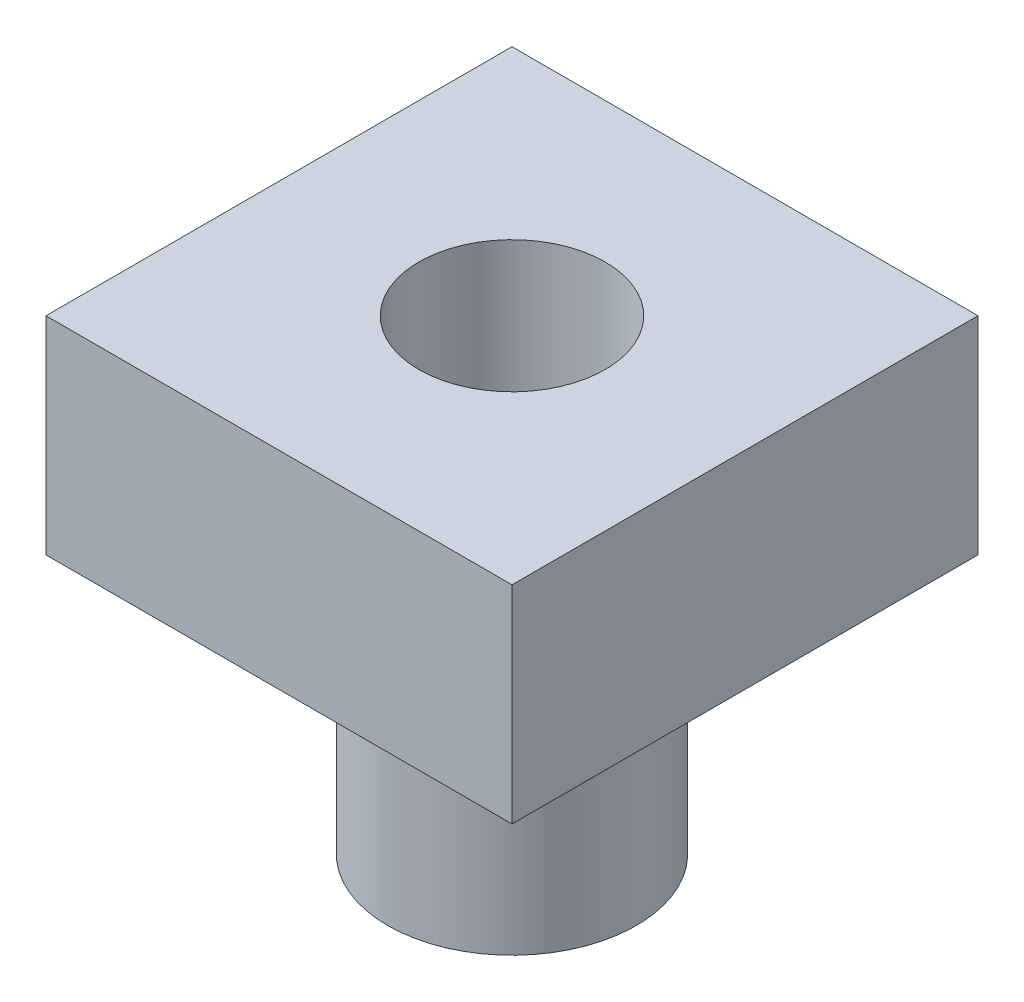
ISO-10303-21;
HEADER;
FILE_DESCRIPTION(('STEP AP214'),'2;1');
FILE_NAME('part.step','',(''),(''),'','','');
FILE_SCHEMA(('AUTOMOTIVE_DESIGN { 1 0 10303 214 1 1 1 1 }'));
ENDSEC;
DATA;
#1=APPLICATION_CONTEXT('core data for automotive mechanical design processes');
#2=APPLICATION_PROTOCOL_DEFINITION('international standard','automotive_design',2000,#1);
#3=PRODUCT_CONTEXT('',#1,'mechanical');
#4=PRODUCT('Part','Part','',(#3));
#5=PRODUCT_RELATED_PRODUCT_CATEGORY('part','',(#4));
#6=PRODUCT_DEFINITION_FORMATION('','',#4);
#7=PRODUCT_DEFINITION_CONTEXT('part definition',#1,'design');
#8=PRODUCT_DEFINITION('design','',#6,#7);
#9=PRODUCT_DEFINITION_SHAPE('','',#8);
#10=(LENGTH_UNIT() NAMED_UNIT(*) SI_UNIT(.MILLI.,.METRE.));
#11=(NAMED_UNIT(*) PLANE_ANGLE_UNIT() SI_UNIT($,.RADIAN.));
#12=(NAMED_UNIT(*) SI_UNIT($,.STERADIAN.) SOLID_ANGLE_UNIT());
#13=UNCERTAINTY_MEASURE_WITH_UNIT(LENGTH_MEASURE(1.E-05),#10,'distance_accuracy_value','');
#14=(GEOMETRIC_REPRESENTATION_CONTEXT(3) GLOBAL_UNCERTAINTY_ASSIGNED_CONTEXT((#13)) GLOBAL_UNIT_ASSIGNED_CONTEXT((#10,
#11,#12)) REPRESENTATION_CONTEXT('',''));
#15=CARTESIAN_POINT('',(0.,0.,0.));
#16=DIRECTION('',(0.,0.,1.));
#17=DIRECTION('',(1.,0.,0.));
#18=AXIS2_PLACEMENT_3D('',#15,#16,#17);
#19=CARTESIAN_POINT('',(0.,-140.,0.));
#20=DIRECTION('',(0.,1.,0.));
#21=DIRECTION('',(0.,0.,1.));
#22=AXIS2_PLACEMENT_3D('',#19,#20,#21);
#23=PLANE('',#22);
#24=CARTESIAN_POINT('',(0.,-140.,0.));
#25=DIRECTION('',(0.,1.,0.));
#26=DIRECTION('',(0.,0.,1.));
#27=AXIS2_PLACEMENT_3D('',#24,#25,#26);
#28=CIRCLE('',#27,14.5);
#29=CARTESIAN_POINT('',(0.,-140.,14.5));
#30=VERTEX_POINT('',#29);
#31=EDGE_CURVE('E13',#30,#30,#28,.T.);
#32=ORIENTED_EDGE('',*,*,#31,.T.);
#33=EDGE_LOOP('',(#32));
#34=FACE_BOUND('',#33,.T.);
#35=DIRECTION('',(0.,0.,-1.));
#36=VECTOR('',#35,1.);
#37=CARTESIAN_POINT('',(-22.5,-140.,-22.5));
#38=LINE('',#37,#36);
#39=CARTESIAN_POINT('',(-22.5,-140.,22.5));
#40=VERTEX_POINT('',#39);
#41=CARTESIAN_POINT('',(-22.5,-140.,-22.5));
#42=VERTEX_POINT('',#41);
#43=EDGE_CURVE('E614',#40,#42,#38,.T.);
#44=ORIENTED_EDGE('',*,*,#43,.T.);
#45=DIRECTION('',(1.,0.,0.));
#46=VECTOR('',#45,1.);
#47=CARTESIAN_POINT('',(-22.5,-140.,-22.5));
#48=LINE('',#47,#46);
#49=CARTESIAN_POINT('',(22.5,-140.,-22.5));
#50=VERTEX_POINT('',#49);
#51=EDGE_CURVE('E610',#42,#50,#48,.T.);
#52=ORIENTED_EDGE('',*,*,#51,.T.);
#53=DIRECTION('',(0.,0.,1.));
#54=VECTOR('',#53,1.);
#55=CARTESIAN_POINT('',(22.5,-140.,-22.5));
#56=LINE('',#55,#54);
#57=CARTESIAN_POINT('',(22.5,-140.,22.5));
#58=VERTEX_POINT('',#57);
#59=EDGE_CURVE('E612',#50,#58,#56,.T.);
#60=ORIENTED_EDGE('',*,*,#59,.T.);
#61=DIRECTION('',(-1.,0.,0.));
#62=VECTOR('',#61,1.);
#63=CARTESIAN_POINT('',(-22.5,-140.,22.5));
#64=LINE('',#63,#62);
#65=EDGE_CURVE('E579',#58,#40,#64,.T.);
#66=ORIENTED_EDGE('',*,*,#65,.T.);
#67=EDGE_LOOP('',(#44,#52,#60,#66));
#68=FACE_BOUND('',#67,.T.);
#69=ADVANCED_FACE('F561',(#34,#68),#23,.F.);
#70=CARTESIAN_POINT('',(0.,-120.,0.));
#71=DIRECTION('',(0.,1.,0.));
#72=DIRECTION('',(0.,0.,1.));
#73=AXIS2_PLACEMENT_3D('',#70,#71,#72);
#74=PLANE('',#73);
#75=DIRECTION('',(0.,0.,-1.));
#76=VECTOR('',#75,1.);
#77=CARTESIAN_POINT('',(-22.5,-120.,-22.5));
#78=LINE('',#77,#76);
#79=CARTESIAN_POINT('',(-22.5,-120.,22.5));
#80=VERTEX_POINT('',#79);
#81=CARTESIAN_POINT('',(-22.5,-120.,-22.5));
#82=VERTEX_POINT('',#81);
#83=EDGE_CURVE('E633',#80,#82,#78,.T.);
#84=ORIENTED_EDGE('',*,*,#83,.F.);
#85=DIRECTION('',(-1.,0.,0.));
#86=VECTOR('',#85,1.);
#87=CARTESIAN_POINT('',(-22.5,-120.,22.5));
#88=LINE('',#87,#86);
#89=CARTESIAN_POINT('',(22.5,-120.,22.5));
#90=VERTEX_POINT('',#89);
#91=EDGE_CURVE('E602',#90,#80,#88,.T.);
#92=ORIENTED_EDGE('',*,*,#91,.F.);
#93=DIRECTION('',(0.,0.,1.));
#94=VECTOR('',#93,1.);
#95=CARTESIAN_POINT('',(22.5,-120.,-22.5));
#96=LINE('',#95,#94);
#97=CARTESIAN_POINT('',(22.5,-120.,-22.5));
#98=VERTEX_POINT('',#97);
#99=EDGE_CURVE('E596',#98,#90,#96,.T.);
#100=ORIENTED_EDGE('',*,*,#99,.F.);
#101=DIRECTION('',(1.,0.,0.));
#102=VECTOR('',#101,1.);
#103=CARTESIAN_POINT('',(-22.5,-120.,-22.5));
#104=LINE('',#103,#102);
#105=EDGE_CURVE('E620',#82,#98,#104,.T.);
#106=ORIENTED_EDGE('',*,*,#105,.F.);
#107=EDGE_LOOP('',(#84,#92,#100,#106));
#108=FACE_BOUND('',#107,.T.);
#109=CARTESIAN_POINT('',(0.,-120.,0.));
#110=DIRECTION('',(0.,-1.,0.));
#111=DIRECTION('',(0.,0.,-1.));
#112=AXIS2_PLACEMENT_3D('',#109,#110,#111);
#113=CIRCLE('',#112,9.);
#114=CARTESIAN_POINT('',(0.,-120.,-9.));
#115=VERTEX_POINT('',#114);
#116=EDGE_CURVE('E637',#115,#115,#113,.T.);
#117=ORIENTED_EDGE('',*,*,#116,.T.);
#118=EDGE_LOOP('',(#117));
#119=FACE_BOUND('',#118,.T.);
#120=ADVANCED_FACE('F665',(#108,#119),#74,.T.);
#121=CARTESIAN_POINT('',(-22.5,-140.,-22.5));
#122=DIRECTION('',(1.,0.,0.));
#123=DIRECTION('',(0.,0.,-1.));
#124=AXIS2_PLACEMENT_3D('',#121,#122,#123);
#125=PLANE('',#124);
#126=ORIENTED_EDGE('',*,*,#83,.T.);
#127=DIRECTION('',(0.,1.,0.));
#128=VECTOR('',#127,1.);
#129=CARTESIAN_POINT('',(-22.5,-140.,-22.5));
#130=LINE('',#129,#128);
#131=EDGE_CURVE('E622',#42,#82,#130,.T.);
#132=ORIENTED_EDGE('',*,*,#131,.F.);
#133=ORIENTED_EDGE('',*,*,#43,.F.);
#134=DIRECTION('',(0.,1.,0.));
#135=VECTOR('',#134,1.);
#136=CARTESIAN_POINT('',(-22.5,-140.,22.5));
#137=LINE('',#136,#135);
#138=EDGE_CURVE('E629',#40,#80,#137,.T.);
#139=ORIENTED_EDGE('',*,*,#138,.T.);
#140=EDGE_LOOP('',(#126,#132,#133,#139));
#141=FACE_BOUND('',#140,.T.);
#142=ADVANCED_FACE('F671',(#141),#125,.F.);
#143=CARTESIAN_POINT('',(-22.5,-140.,-22.5));
#144=DIRECTION('',(0.,0.,1.));
#145=DIRECTION('',(1.,0.,0.));
#146=AXIS2_PLACEMENT_3D('',#143,#144,#145);
#147=PLANE('',#146);
#148=ORIENTED_EDGE('',*,*,#105,.T.);
#149=DIRECTION('',(0.,1.,0.));
#150=VECTOR('',#149,1.);
#151=CARTESIAN_POINT('',(22.5,-140.,-22.5));
#152=LINE('',#151,#150);
#153=EDGE_CURVE('E618',#50,#98,#152,.T.);
#154=ORIENTED_EDGE('',*,*,#153,.F.);
#155=ORIENTED_EDGE('',*,*,#51,.F.);
#156=ORIENTED_EDGE('',*,*,#131,.T.);
#157=EDGE_LOOP('',(#148,#154,#155,#156));
#158=FACE_BOUND('',#157,.T.);
#159=ADVANCED_FACE('F619',(#158),#147,.F.);
#160=CARTESIAN_POINT('',(22.5,-140.,-22.5));
#161=DIRECTION('',(-1.,0.,0.));
#162=DIRECTION('',(0.,0.,1.));
#163=AXIS2_PLACEMENT_3D('',#160,#161,#162);
#164=PLANE('',#163);
#165=ORIENTED_EDGE('',*,*,#99,.T.);
#166=DIRECTION('',(0.,1.,0.));
#167=VECTOR('',#166,1.);
#168=CARTESIAN_POINT('',(22.5,-140.,22.5));
#169=LINE('',#168,#167);
#170=EDGE_CURVE('E623',#58,#90,#169,.T.);
#171=ORIENTED_EDGE('',*,*,#170,.F.);
#172=ORIENTED_EDGE('',*,*,#59,.F.);
#173=ORIENTED_EDGE('',*,*,#153,.T.);
#174=EDGE_LOOP('',(#165,#171,#172,#173));
#175=FACE_BOUND('',#174,.T.);
#176=ADVANCED_FACE('F625',(#175),#164,.F.);
#177=CARTESIAN_POINT('',(-22.5,-140.,22.5));
#178=DIRECTION('',(0.,0.,-1.));
#179=DIRECTION('',(-1.,0.,0.));
#180=AXIS2_PLACEMENT_3D('',#177,#178,#179);
#181=PLANE('',#180);
#182=ORIENTED_EDGE('',*,*,#91,.T.);
#183=ORIENTED_EDGE('',*,*,#138,.F.);
#184=ORIENTED_EDGE('',*,*,#65,.F.);
#185=ORIENTED_EDGE('',*,*,#170,.T.);
#186=EDGE_LOOP('',(#182,#183,#184,#185));
#187=FACE_BOUND('',#186,.T.);
#188=ADVANCED_FACE('F677',(#187),#181,.F.);
#189=CARTESIAN_POINT('',(0.,-140.,0.));
#190=DIRECTION('',(0.,1.,0.));
#191=DIRECTION('',(0.,0.,1.));
#192=AXIS2_PLACEMENT_3D('',#189,#190,#191);
#193=CYLINDRICAL_SURFACE('',#192,9.);
#194=ORIENTED_EDGE('',*,*,#116,.F.);
#195=EDGE_LOOP('',(#194));
#196=FACE_BOUND('',#195,.T.);
#197=CARTESIAN_POINT('',(0.,-165.,0.));
#198=DIRECTION('',(0.,-1.,0.));
#199=DIRECTION('',(0.,0.,-1.));
#200=AXIS2_PLACEMENT_3D('',#197,#198,#199);
#201=CIRCLE('',#200,9.);
#202=CARTESIAN_POINT('',(0.,-165.,-9.));
#203=VERTEX_POINT('',#202);
#204=EDGE_CURVE('E697',#203,#203,#201,.T.);
#205=ORIENTED_EDGE('',*,*,#204,.T.);
#206=EDGE_LOOP('',(#205));
#207=FACE_BOUND('',#206,.T.);
#208=ADVANCED_FACE('F675',(#196,#207),#193,.F.);
#209=CARTESIAN_POINT('',(0.,-165.,0.));
#210=DIRECTION('',(0.,-1.,0.));
#211=DIRECTION('',(0.,0.,-1.));
#212=AXIS2_PLACEMENT_3D('',#209,#210,#211);
#213=PLANE('',#212);
#214=CARTESIAN_POINT('',(0.,-165.,0.));
#215=DIRECTION('',(0.,-1.,0.));
#216=DIRECTION('',(0.,0.,-1.));
#217=AXIS2_PLACEMENT_3D('',#214,#215,#216);
#218=CIRCLE('',#217,12.);
#219=CARTESIAN_POINT('',(0.,-165.,-12.));
#220=VERTEX_POINT('',#219);
#221=EDGE_CURVE('E693',#220,#220,#218,.T.);
#222=ORIENTED_EDGE('',*,*,#221,.T.);
#223=EDGE_LOOP('',(#222));
#224=FACE_BOUND('',#223,.T.);
#225=ORIENTED_EDGE('',*,*,#204,.F.);
#226=EDGE_LOOP('',(#225));
#227=FACE_BOUND('',#226,.T.);
#228=ADVANCED_FACE('F661',(#224,#227),#213,.T.);
#229=CARTESIAN_POINT('',(0.,-165.,0.));
#230=DIRECTION('',(0.,1.,0.));
#231=DIRECTION('',(0.,0.,1.));
#232=AXIS2_PLACEMENT_3D('',#229,#230,#231);
#233=CYLINDRICAL_SURFACE('',#232,12.);
#234=CARTESIAN_POINT('',(0.,-142.5,0.));
#235=DIRECTION('',(0.,1.,0.));
#236=DIRECTION('',(0.,0.,1.));
#237=AXIS2_PLACEMENT_3D('',#234,#235,#236);
#238=CIRCLE('',#237,12.);
#239=CARTESIAN_POINT('',(0.,-142.5,12.));
#240=VERTEX_POINT('',#239);
#241=EDGE_CURVE('E571',#240,#240,#238,.F.);
#242=ORIENTED_EDGE('',*,*,#241,.T.);
#243=EDGE_LOOP('',(#242));
#244=FACE_BOUND('',#243,.T.);
#245=ORIENTED_EDGE('',*,*,#221,.F.);
#246=EDGE_LOOP('',(#245));
#247=FACE_BOUND('',#246,.T.);
#248=ADVANCED_FACE('F653',(#244,#247),#233,.T.);
#249=CARTESIAN_POINT('',(0.,-142.5,0.));
#250=DIRECTION('',(0.,1.,0.));
#251=DIRECTION('',(0.,0.,1.));
#252=AXIS2_PLACEMENT_3D('',#249,#250,#251);
#253=TOROIDAL_SURFACE('',#252,14.5,2.5);
#254=ORIENTED_EDGE('',*,*,#31,.F.);
#255=EDGE_LOOP('',(#254));
#256=FACE_BOUND('',#255,.T.);
#257=ORIENTED_EDGE('',*,*,#241,.F.);
#258=EDGE_LOOP('',(#257));
#259=FACE_BOUND('',#258,.T.);
#260=ADVANCED_FACE('F563',(#256,#259),#253,.F.);
#261=CLOSED_SHELL('',(#69,#120,#142,#159,#176,#188,#208,#228,#248,#260));
#262=MANIFOLD_SOLID_BREP('B2',#261);
#263=ADVANCED_BREP_SHAPE_REPRESENTATION('',(#18,#262),#14);
#264=SHAPE_DEFINITION_REPRESENTATION(#9,#263);
ENDSEC;
END-ISO-10303-21;
